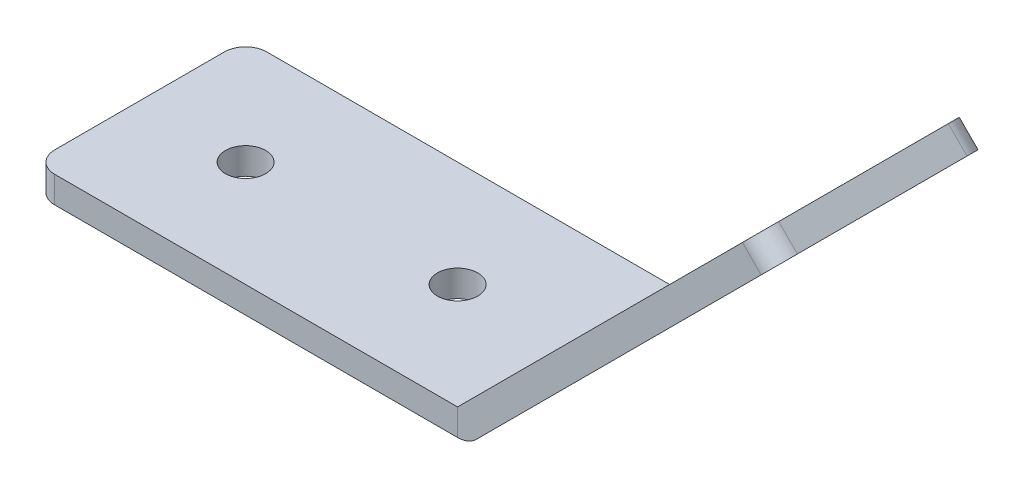
ISO-10303-21;
HEADER;
FILE_DESCRIPTION(('STEP AP214'),'2;1');
FILE_NAME('part.step','',(''),(''),'','','');
FILE_SCHEMA(('AUTOMOTIVE_DESIGN { 1 0 10303 214 1 1 1 1 }'));
ENDSEC;
DATA;
#1=APPLICATION_CONTEXT('core data for automotive mechanical design processes');
#2=APPLICATION_PROTOCOL_DEFINITION('international standard','automotive_design',2000,#1);
#3=PRODUCT_CONTEXT('',#1,'mechanical');
#4=PRODUCT('Part','Part','',(#3));
#5=PRODUCT_RELATED_PRODUCT_CATEGORY('part','',(#4));
#6=PRODUCT_DEFINITION_FORMATION('','',#4);
#7=PRODUCT_DEFINITION_CONTEXT('part definition',#1,'design');
#8=PRODUCT_DEFINITION('design','',#6,#7);
#9=PRODUCT_DEFINITION_SHAPE('','',#8);
#10=(LENGTH_UNIT() NAMED_UNIT(*) SI_UNIT(.MILLI.,.METRE.));
#11=(NAMED_UNIT(*) PLANE_ANGLE_UNIT() SI_UNIT($,.RADIAN.));
#12=(NAMED_UNIT(*) SI_UNIT($,.STERADIAN.) SOLID_ANGLE_UNIT());
#13=UNCERTAINTY_MEASURE_WITH_UNIT(LENGTH_MEASURE(1.E-05),#10,'distance_accuracy_value','');
#14=(GEOMETRIC_REPRESENTATION_CONTEXT(3) GLOBAL_UNCERTAINTY_ASSIGNED_CONTEXT((#13)) GLOBAL_UNIT_ASSIGNED_CONTEXT((#10,
#11,#12)) REPRESENTATION_CONTEXT('',''));
#15=CARTESIAN_POINT('',(0.,0.,0.));
#16=DIRECTION('',(0.,0.,1.));
#17=DIRECTION('',(1.,0.,0.));
#18=AXIS2_PLACEMENT_3D('',#15,#16,#17);
#19=CARTESIAN_POINT('',(50.8,3.175,-54.6365211463464));
#20=DIRECTION('',(-1.,0.,0.));
#21=DIRECTION('',(0.,0.,1.));
#22=AXIS2_PLACEMENT_3D('',#19,#20,#21);
#23=PLANE('',#22);
#24=DIRECTION('',(0.,1.,0.));
#25=VECTOR('',#24,1.);
#26=CARTESIAN_POINT('',(50.8,3.175,0.));
#27=LINE('',#26,#25);
#28=CARTESIAN_POINT('',(50.8,0.,0.));
#29=VERTEX_POINT('',#28);
#30=CARTESIAN_POINT('',(50.8,3.175,0.));
#31=VERTEX_POINT('',#30);
#32=EDGE_CURVE('E117',#29,#31,#27,.T.);
#33=ORIENTED_EDGE('',*,*,#32,.F.);
#34=DIRECTION('',(0.,0.,1.));
#35=VECTOR('',#34,1.);
#36=CARTESIAN_POINT('',(50.8,0.,-54.6365211463464));
#37=LINE('',#36,#35);
#38=CARTESIAN_POINT('',(50.8,0.,25.4));
#39=VERTEX_POINT('',#38);
#40=EDGE_CURVE('E112',#29,#39,#37,.T.);
#41=ORIENTED_EDGE('',*,*,#40,.T.);
#42=DIRECTION('',(0.,-1.,0.));
#43=VECTOR('',#42,1.);
#44=CARTESIAN_POINT('',(50.8,3.175,25.4));
#45=LINE('',#44,#43);
#46=CARTESIAN_POINT('',(50.8,3.175,25.4));
#47=VERTEX_POINT('',#46);
#48=EDGE_CURVE('E116',#47,#39,#45,.T.);
#49=ORIENTED_EDGE('',*,*,#48,.F.);
#50=DIRECTION('',(0.,0.,1.));
#51=VECTOR('',#50,1.);
#52=CARTESIAN_POINT('',(50.8,3.175,-54.6365211463464));
#53=LINE('',#52,#51);
#54=EDGE_CURVE('E152',#31,#47,#53,.T.);
#55=ORIENTED_EDGE('',*,*,#54,.F.);
#56=EDGE_LOOP('',(#33,#41,#49,#55));
#57=FACE_BOUND('',#56,.T.);
#58=ADVANCED_FACE('F49',(#57),#23,.T.);
#59=CARTESIAN_POINT('',(50.8,3.175,-54.6365211463464));
#60=DIRECTION('',(-0.707106781186549,0.707106781186547,0.));
#61=DIRECTION('',(-0.707106781186546,-0.707106781186549,0.));
#62=AXIS2_PLACEMENT_3D('',#59,#60,#61);
#63=PLANE('',#62);
#64=CARTESIAN_POINT('',(59.7802561210691,12.1552561210692,12.7));
#65=DIRECTION('',(-0.707106781186549,0.707106781186546,0.));
#66=DIRECTION('',(-0.707106781186546,-0.707106781186549,0.));
#67=AXIS2_PLACEMENT_3D('',#64,#65,#66);
#68=CIRCLE('',#67,2.413);
#69=CARTESIAN_POINT('',(58.074007458066,10.449007458066,12.7));
#70=VERTEX_POINT('',#69);
#71=EDGE_CURVE('E143',#70,#70,#68,.T.);
#72=ORIENTED_EDGE('',*,*,#71,.F.);
#73=EDGE_LOOP('',(#72));
#74=FACE_BOUND('',#73,.T.);
#75=CARTESIAN_POINT('',(77.7407683632074,30.1157683632075,12.7));
#76=DIRECTION('',(-0.707106781186549,0.707106781186546,0.));
#77=DIRECTION('',(-0.707106781186546,-0.707106781186549,0.));
#78=AXIS2_PLACEMENT_3D('',#75,#76,#77);
#79=CIRCLE('',#78,2.413);
#80=CARTESIAN_POINT('',(76.0345197002043,28.4095197002044,12.7));
#81=VERTEX_POINT('',#80);
#82=EDGE_CURVE('E209',#81,#81,#79,.T.);
#83=ORIENTED_EDGE('',*,*,#82,.F.);
#84=EDGE_LOOP('',(#83));
#85=FACE_BOUND('',#84,.T.);
#86=DIRECTION('',(-0.707106781186546,-0.707106781186549,0.));
#87=VECTOR('',#86,1.);
#88=CARTESIAN_POINT('',(50.8,3.175,25.4));
#89=LINE('',#88,#87);
#90=CARTESIAN_POINT('',(84.9249732600627,37.2999732600628,25.4));
#91=VERTEX_POINT('',#90);
#92=EDGE_CURVE('E122',#91,#47,#89,.T.);
#93=ORIENTED_EDGE('',*,*,#92,.F.);
#94=CARTESIAN_POINT('',(84.9249732600627,37.2999732600628,22.86));
#95=DIRECTION('',(-0.707106781186549,0.707106781186547,0.));
#96=DIRECTION('',(-0.707106781186546,-0.707106781186549,0.));
#97=AXIS2_PLACEMENT_3D('',#94,#95,#96);
#98=CIRCLE('',#97,2.54);
#99=CARTESIAN_POINT('',(86.7210244842766,39.0960244842767,22.86));
#100=VERTEX_POINT('',#99);
#101=EDGE_CURVE('E173',#91,#100,#98,.T.);
#102=ORIENTED_EDGE('',*,*,#101,.T.);
#103=DIRECTION('',(0.,0.,1.));
#104=VECTOR('',#103,1.);
#105=CARTESIAN_POINT('',(86.7210244842766,39.0960244842767,-54.6365211463464));
#106=LINE('',#105,#104);
#107=CARTESIAN_POINT('',(86.7210244842766,39.0960244842767,2.53999999999999));
#108=VERTEX_POINT('',#107);
#109=EDGE_CURVE('E156',#108,#100,#106,.T.);
#110=ORIENTED_EDGE('',*,*,#109,.F.);
#111=CARTESIAN_POINT('',(84.9249732600627,37.2999732600628,2.54));
#112=DIRECTION('',(-0.707106781186549,0.707106781186547,0.));
#113=DIRECTION('',(-0.707106781186546,-0.707106781186549,0.));
#114=AXIS2_PLACEMENT_3D('',#111,#112,#113);
#115=CIRCLE('',#114,2.54);
#116=CARTESIAN_POINT('',(84.9249732600627,37.2999732600628,0.));
#117=VERTEX_POINT('',#116);
#118=EDGE_CURVE('E170',#108,#117,#115,.T.);
#119=ORIENTED_EDGE('',*,*,#118,.T.);
#120=DIRECTION('',(0.707106781186546,0.707106781186549,0.));
#121=VECTOR('',#120,1.);
#122=CARTESIAN_POINT('',(50.8,3.175,0.));
#123=LINE('',#122,#121);
#124=EDGE_CURVE('E196',#31,#117,#123,.T.);
#125=ORIENTED_EDGE('',*,*,#124,.F.);
#126=ORIENTED_EDGE('',*,*,#54,.T.);
#127=EDGE_LOOP('',(#93,#102,#110,#119,#125,#126));
#128=FACE_BOUND('',#127,.T.);
#129=ADVANCED_FACE('F191',(#74,#85,#128),#63,.T.);
#130=CARTESIAN_POINT('',(88.9660885145438,36.8509604540094,-54.6365211463464));
#131=DIRECTION('',(0.707106781186545,0.70710678118655,0.));
#132=DIRECTION('',(-0.70710678118655,0.707106781186545,0.));
#133=AXIS2_PLACEMENT_3D('',#130,#131,#132);
#134=PLANE('',#133);
#135=ORIENTED_EDGE('',*,*,#109,.T.);
#136=DIRECTION('',(-0.70710678118655,0.707106781186545,0.));
#137=VECTOR('',#136,1.);
#138=CARTESIAN_POINT('',(88.9660885145438,36.8509604540094,22.86));
#139=LINE('',#138,#137);
#140=CARTESIAN_POINT('',(88.9660885145438,36.8509604540094,22.86));
#141=VERTEX_POINT('',#140);
#142=EDGE_CURVE('E72',#100,#141,#139,.F.);
#143=ORIENTED_EDGE('',*,*,#142,.T.);
#144=DIRECTION('',(0.,0.,1.));
#145=VECTOR('',#144,1.);
#146=CARTESIAN_POINT('',(88.9660885145438,36.8509604540094,-54.6365211463464));
#147=LINE('',#146,#145);
#148=CARTESIAN_POINT('',(88.9660885145438,36.8509604540094,2.53999999999999));
#149=VERTEX_POINT('',#148);
#150=EDGE_CURVE('E159',#149,#141,#147,.T.);
#151=ORIENTED_EDGE('',*,*,#150,.F.);
#152=DIRECTION('',(0.70710678118655,-0.707106781186545,0.));
#153=VECTOR('',#152,1.);
#154=CARTESIAN_POINT('',(86.7210244842766,39.0960244842767,2.54));
#155=LINE('',#154,#153);
#156=EDGE_CURVE('E176',#149,#108,#155,.F.);
#157=ORIENTED_EDGE('',*,*,#156,.T.);
#158=EDGE_LOOP('',(#135,#143,#151,#157));
#159=FACE_BOUND('',#158,.T.);
#160=ADVANCED_FACE('F193',(#159),#134,.T.);
#161=CARTESIAN_POINT('',(53.0450640302673,0.92993596973271,-54.6365211463464));
#162=DIRECTION('',(0.707106781186549,-0.707106781186546,0.));
#163=DIRECTION('',(0.707106781186546,0.707106781186549,0.));
#164=AXIS2_PLACEMENT_3D('',#161,#162,#163);
#165=PLANE('',#164);
#166=CARTESIAN_POINT('',(62.0253201513364,9.91019209080188,12.7));
#167=DIRECTION('',(0.707106781186549,-0.707106781186546,0.));
#168=DIRECTION('',(0.707106781186546,0.707106781186549,0.));
#169=AXIS2_PLACEMENT_3D('',#166,#167,#168);
#170=CIRCLE('',#169,2.413);
#171=CARTESIAN_POINT('',(63.7315688143396,11.616440753805,12.7));
#172=VERTEX_POINT('',#171);
#173=EDGE_CURVE('E139',#172,#172,#170,.F.);
#174=ORIENTED_EDGE('',*,*,#173,.T.);
#175=EDGE_LOOP('',(#174));
#176=FACE_BOUND('',#175,.T.);
#177=CARTESIAN_POINT('',(79.9858323934747,27.8707043329402,12.7));
#178=DIRECTION('',(0.707106781186549,-0.707106781186546,0.));
#179=DIRECTION('',(0.707106781186546,0.707106781186549,0.));
#180=AXIS2_PLACEMENT_3D('',#177,#178,#179);
#181=CIRCLE('',#180,2.413);
#182=CARTESIAN_POINT('',(81.6920810564778,29.5769529959434,12.7));
#183=VERTEX_POINT('',#182);
#184=EDGE_CURVE('E205',#183,#183,#181,.F.);
#185=ORIENTED_EDGE('',*,*,#184,.T.);
#186=EDGE_LOOP('',(#185));
#187=FACE_BOUND('',#186,.T.);
#188=ORIENTED_EDGE('',*,*,#150,.T.);
#189=CARTESIAN_POINT('',(87.17003729033,35.0549092297956,22.86));
#190=DIRECTION('',(0.707106781186549,-0.707106781186546,0.));
#191=DIRECTION('',(0.707106781186546,0.707106781186549,0.));
#192=AXIS2_PLACEMENT_3D('',#189,#190,#191);
#193=CIRCLE('',#192,2.54);
#194=CARTESIAN_POINT('',(87.17003729033,35.0549092297956,25.4));
#195=VERTEX_POINT('',#194);
#196=EDGE_CURVE('E58',#141,#195,#193,.T.);
#197=ORIENTED_EDGE('',*,*,#196,.T.);
#198=DIRECTION('',(0.707106781186546,0.707106781186549,0.));
#199=VECTOR('',#198,1.);
#200=CARTESIAN_POINT('',(53.0450640302673,0.92993596973271,25.4));
#201=LINE('',#200,#199);
#202=CARTESIAN_POINT('',(53.0450640302673,0.92993596973271,25.4));
#203=VERTEX_POINT('',#202);
#204=EDGE_CURVE('E132',#203,#195,#201,.T.);
#205=ORIENTED_EDGE('',*,*,#204,.F.);
#206=DIRECTION('',(0.,0.,1.));
#207=VECTOR('',#206,1.);
#208=CARTESIAN_POINT('',(53.0450640302673,0.92993596973271,-54.6365211463464));
#209=LINE('',#208,#207);
#210=CARTESIAN_POINT('',(53.0450640302673,0.92993596973271,0.));
#211=VERTEX_POINT('',#210);
#212=EDGE_CURVE('E121',#211,#203,#209,.T.);
#213=ORIENTED_EDGE('',*,*,#212,.F.);
#214=DIRECTION('',(-0.707106781186546,-0.707106781186549,0.));
#215=VECTOR('',#214,1.);
#216=CARTESIAN_POINT('',(53.0450640302673,0.92993596973271,0.));
#217=LINE('',#216,#215);
#218=CARTESIAN_POINT('',(87.17003729033,35.0549092297956,0.));
#219=VERTEX_POINT('',#218);
#220=EDGE_CURVE('E155',#219,#211,#217,.T.);
#221=ORIENTED_EDGE('',*,*,#220,.F.);
#222=CARTESIAN_POINT('',(87.17003729033,35.0549092297956,2.54));
#223=DIRECTION('',(0.707106781186549,-0.707106781186546,0.));
#224=DIRECTION('',(0.707106781186546,0.707106781186549,0.));
#225=AXIS2_PLACEMENT_3D('',#222,#223,#224);
#226=CIRCLE('',#225,2.54);
#227=EDGE_CURVE('E65',#219,#149,#226,.T.);
#228=ORIENTED_EDGE('',*,*,#227,.T.);
#229=EDGE_LOOP('',(#188,#197,#205,#213,#221,#228));
#230=FACE_BOUND('',#229,.T.);
#231=ADVANCED_FACE('F185',(#176,#187,#230),#165,.T.);
#232=CARTESIAN_POINT('',(50.8,3.175,-54.6365211463464));
#233=DIRECTION('',(0.,0.,1.));
#234=DIRECTION('',(1.,0.,0.));
#235=AXIS2_PLACEMENT_3D('',#232,#233,#234);
#236=CYLINDRICAL_SURFACE('',#235,3.17500000000001);
#237=CARTESIAN_POINT('',(50.8,3.175,0.));
#238=DIRECTION('',(0.,0.,1.));
#239=DIRECTION('',(1.,0.,0.));
#240=AXIS2_PLACEMENT_3D('',#237,#238,#239);
#241=CIRCLE('',#240,3.17500000000001);
#242=EDGE_CURVE('E164',#211,#29,#241,.F.);
#243=ORIENTED_EDGE('',*,*,#242,.F.);
#244=ORIENTED_EDGE('',*,*,#212,.T.);
#245=CARTESIAN_POINT('',(50.8,3.175,25.4));
#246=DIRECTION('',(0.,0.,1.));
#247=DIRECTION('',(1.,0.,0.));
#248=AXIS2_PLACEMENT_3D('',#245,#246,#247);
#249=CIRCLE('',#248,3.17500000000001);
#250=EDGE_CURVE('E125',#39,#203,#249,.T.);
#251=ORIENTED_EDGE('',*,*,#250,.F.);
#252=ORIENTED_EDGE('',*,*,#40,.F.);
#253=EDGE_LOOP('',(#243,#244,#251,#252));
#254=FACE_BOUND('',#253,.T.);
#255=ADVANCED_FACE('F126',(#254),#236,.T.);
#256=CARTESIAN_POINT('',(50.8,3.175,25.4));
#257=DIRECTION('',(0.,0.,1.));
#258=DIRECTION('',(1.,0.,0.));
#259=AXIS2_PLACEMENT_3D('',#256,#257,#258);
#260=PLANE('',#259);
#261=ORIENTED_EDGE('',*,*,#204,.T.);
#262=DIRECTION('',(-0.70710678118655,0.707106781186545,0.));
#263=VECTOR('',#262,1.);
#264=CARTESIAN_POINT('',(84.9249732600627,37.2999732600629,25.4));
#265=LINE('',#264,#263);
#266=EDGE_CURVE('E167',#195,#91,#265,.T.);
#267=ORIENTED_EDGE('',*,*,#266,.T.);
#268=ORIENTED_EDGE('',*,*,#92,.T.);
#269=ORIENTED_EDGE('',*,*,#48,.T.);
#270=ORIENTED_EDGE('',*,*,#250,.T.);
#271=EDGE_LOOP('',(#261,#267,#268,#269,#270));
#272=FACE_BOUND('',#271,.T.);
#273=ADVANCED_FACE('F134',(#272),#260,.T.);
#274=CARTESIAN_POINT('',(0.,3.175,0.));
#275=DIRECTION('',(0.,0.,1.));
#276=DIRECTION('',(1.,0.,0.));
#277=AXIS2_PLACEMENT_3D('',#274,#275,#276);
#278=PLANE('',#277);
#279=ORIENTED_EDGE('',*,*,#124,.T.);
#280=DIRECTION('',(0.70710678118655,-0.707106781186545,0.));
#281=VECTOR('',#280,1.);
#282=CARTESIAN_POINT('',(87.17003729033,35.0549092297956,0.));
#283=LINE('',#282,#281);
#284=EDGE_CURVE('E12',#117,#219,#283,.T.);
#285=ORIENTED_EDGE('',*,*,#284,.T.);
#286=ORIENTED_EDGE('',*,*,#220,.T.);
#287=ORIENTED_EDGE('',*,*,#242,.T.);
#288=ORIENTED_EDGE('',*,*,#32,.T.);
#289=EDGE_LOOP('',(#279,#285,#286,#287,#288));
#290=FACE_BOUND('',#289,.T.);
#291=ADVANCED_FACE('F198',(#290),#278,.F.);
#292=CARTESIAN_POINT('',(84.8118323934747,23.0447043329402,12.7));
#293=DIRECTION('',(-0.707106781186549,0.707106781186546,0.));
#294=DIRECTION('',(-0.707106781186546,-0.707106781186549,0.));
#295=AXIS2_PLACEMENT_3D('',#292,#293,#294);
#296=CYLINDRICAL_SURFACE('',#295,2.413);
#297=ORIENTED_EDGE('',*,*,#82,.T.);
#298=EDGE_LOOP('',(#297));
#299=FACE_BOUND('',#298,.T.);
#300=ORIENTED_EDGE('',*,*,#184,.F.);
#301=EDGE_LOOP('',(#300));
#302=FACE_BOUND('',#301,.T.);
#303=ADVANCED_FACE('F225',(#299,#302),#296,.F.);
#304=CARTESIAN_POINT('',(66.8513201513364,5.08419209080189,12.7));
#305=DIRECTION('',(-0.707106781186549,0.707106781186546,0.));
#306=DIRECTION('',(-0.707106781186546,-0.707106781186549,0.));
#307=AXIS2_PLACEMENT_3D('',#304,#305,#306);
#308=CYLINDRICAL_SURFACE('',#307,2.413);
#309=ORIENTED_EDGE('',*,*,#71,.T.);
#310=EDGE_LOOP('',(#309));
#311=FACE_BOUND('',#310,.T.);
#312=ORIENTED_EDGE('',*,*,#173,.F.);
#313=EDGE_LOOP('',(#312));
#314=FACE_BOUND('',#313,.T.);
#315=ADVANCED_FACE('F217',(#311,#314),#308,.F.);
#316=CARTESIAN_POINT('',(84.9249732600627,37.2999732600629,22.86));
#317=DIRECTION('',(-0.70710678118655,0.707106781186545,0.));
#318=DIRECTION('',(-0.707106781186545,-0.70710678118655,0.));
#319=AXIS2_PLACEMENT_3D('',#316,#317,#318);
#320=CYLINDRICAL_SURFACE('',#319,2.54);
#321=ORIENTED_EDGE('',*,*,#196,.F.);
#322=ORIENTED_EDGE('',*,*,#142,.F.);
#323=ORIENTED_EDGE('',*,*,#101,.F.);
#324=ORIENTED_EDGE('',*,*,#266,.F.);
#325=EDGE_LOOP('',(#321,#322,#323,#324));
#326=FACE_BOUND('',#325,.T.);
#327=ADVANCED_FACE('F188',(#326),#320,.T.);
#328=CARTESIAN_POINT('',(59.5249732600625,62.6999732600629,2.54));
#329=DIRECTION('',(-0.70710678118655,0.707106781186545,0.));
#330=DIRECTION('',(-0.707106781186545,-0.70710678118655,0.));
#331=AXIS2_PLACEMENT_3D('',#328,#329,#330);
#332=CYLINDRICAL_SURFACE('',#331,2.54);
#333=ORIENTED_EDGE('',*,*,#118,.F.);
#334=ORIENTED_EDGE('',*,*,#156,.F.);
#335=ORIENTED_EDGE('',*,*,#227,.F.);
#336=ORIENTED_EDGE('',*,*,#284,.F.);
#337=EDGE_LOOP('',(#333,#334,#335,#336));
#338=FACE_BOUND('',#337,.T.);
#339=ADVANCED_FACE('F51',(#338),#332,.T.);
#340=CLOSED_SHELL('',(#58,#129,#160,#231,#255,#273,#291,#303,#315,#327,#339));
#341=MANIFOLD_SOLID_BREP('B2',#340);
#342=CARTESIAN_POINT('',(0.,3.175,0.));
#343=DIRECTION('',(1.,0.,0.));
#344=DIRECTION('',(0.,0.,-1.));
#345=AXIS2_PLACEMENT_3D('',#342,#343,#344);
#346=PLANE('',#345);
#347=DIRECTION('',(0.,0.,1.));
#348=VECTOR('',#347,1.);
#349=CARTESIAN_POINT('',(0.,0.,0.));
#350=LINE('',#349,#348);
#351=CARTESIAN_POINT('',(0.,0.,2.54));
#352=VERTEX_POINT('',#351);
#353=CARTESIAN_POINT('',(0.,0.,22.86));
#354=VERTEX_POINT('',#353);
#355=EDGE_CURVE('E401',#352,#354,#350,.T.);
#356=ORIENTED_EDGE('',*,*,#355,.T.);
#357=DIRECTION('',(0.,-1.,0.));
#358=VECTOR('',#357,1.);
#359=CARTESIAN_POINT('',(0.,3.175,22.86));
#360=LINE('',#359,#358);
#361=CARTESIAN_POINT('',(0.,3.175,22.86));
#362=VERTEX_POINT('',#361);
#363=EDGE_CURVE('E339',#354,#362,#360,.F.);
#364=ORIENTED_EDGE('',*,*,#363,.T.);
#365=DIRECTION('',(0.,0.,1.));
#366=VECTOR('',#365,1.);
#367=CARTESIAN_POINT('',(0.,3.175,0.));
#368=LINE('',#367,#366);
#369=CARTESIAN_POINT('',(0.,3.175,2.54));
#370=VERTEX_POINT('',#369);
#371=EDGE_CURVE('E382',#370,#362,#368,.T.);
#372=ORIENTED_EDGE('',*,*,#371,.F.);
#373=DIRECTION('',(0.,-1.,0.));
#374=VECTOR('',#373,1.);
#375=CARTESIAN_POINT('',(0.,3.175,2.54));
#376=LINE('',#375,#374);
#377=EDGE_CURVE('E415',#370,#352,#376,.T.);
#378=ORIENTED_EDGE('',*,*,#377,.T.);
#379=EDGE_LOOP('',(#356,#364,#372,#378));
#380=FACE_BOUND('',#379,.T.);
#381=ADVANCED_FACE('F318',(#380),#346,.F.);
#382=CARTESIAN_POINT('',(0.,3.175,25.4));
#383=DIRECTION('',(0.,0.,-1.));
#384=DIRECTION('',(-1.,0.,0.));
#385=AXIS2_PLACEMENT_3D('',#382,#383,#384);
#386=PLANE('',#385);
#387=DIRECTION('',(1.,0.,0.));
#388=VECTOR('',#387,1.);
#389=CARTESIAN_POINT('',(0.,3.175,25.4));
#390=LINE('',#389,#388);
#391=CARTESIAN_POINT('',(2.54,3.175,25.4));
#392=VERTEX_POINT('',#391);
#393=CARTESIAN_POINT('',(50.8,3.175,25.4));
#394=VERTEX_POINT('',#393);
#395=EDGE_CURVE('E372',#392,#394,#390,.T.);
#396=ORIENTED_EDGE('',*,*,#395,.F.);
#397=DIRECTION('',(0.,-1.,0.));
#398=VECTOR('',#397,1.);
#399=CARTESIAN_POINT('',(2.54,3.175,25.4));
#400=LINE('',#399,#398);
#401=CARTESIAN_POINT('',(2.54,0.,25.4));
#402=VERTEX_POINT('',#401);
#403=EDGE_CURVE('E391',#392,#402,#400,.T.);
#404=ORIENTED_EDGE('',*,*,#403,.T.);
#405=DIRECTION('',(1.,0.,0.));
#406=VECTOR('',#405,1.);
#407=CARTESIAN_POINT('',(0.,0.,25.4));
#408=LINE('',#407,#406);
#409=CARTESIAN_POINT('',(50.8,0.,25.4));
#410=VERTEX_POINT('',#409);
#411=EDGE_CURVE('E388',#402,#410,#408,.T.);
#412=ORIENTED_EDGE('',*,*,#411,.T.);
#413=DIRECTION('',(0.,-1.,0.));
#414=VECTOR('',#413,1.);
#415=CARTESIAN_POINT('',(50.8,3.175,25.4));
#416=LINE('',#415,#414);
#417=EDGE_CURVE('E385',#394,#410,#416,.T.);
#418=ORIENTED_EDGE('',*,*,#417,.F.);
#419=EDGE_LOOP('',(#396,#404,#412,#418));
#420=FACE_BOUND('',#419,.T.);
#421=ADVANCED_FACE('F386',(#420),#386,.F.);
#422=CARTESIAN_POINT('',(50.8,3.175,0.));
#423=DIRECTION('',(-1.,0.,0.));
#424=DIRECTION('',(0.,0.,1.));
#425=AXIS2_PLACEMENT_3D('',#422,#423,#424);
#426=PLANE('',#425);
#427=DIRECTION('',(0.,0.,-1.));
#428=VECTOR('',#427,1.);
#429=CARTESIAN_POINT('',(50.8,0.,0.));
#430=LINE('',#429,#428);
#431=CARTESIAN_POINT('',(50.8,0.,0.));
#432=VERTEX_POINT('',#431);
#433=EDGE_CURVE('E405',#410,#432,#430,.T.);
#434=ORIENTED_EDGE('',*,*,#433,.T.);
#435=DIRECTION('',(0.,-1.,0.));
#436=VECTOR('',#435,1.);
#437=CARTESIAN_POINT('',(50.8,3.175,0.));
#438=LINE('',#437,#436);
#439=CARTESIAN_POINT('',(50.8,3.175,0.));
#440=VERTEX_POINT('',#439);
#441=EDGE_CURVE('E392',#440,#432,#438,.T.);
#442=ORIENTED_EDGE('',*,*,#441,.F.);
#443=DIRECTION('',(0.,0.,-1.));
#444=VECTOR('',#443,1.);
#445=CARTESIAN_POINT('',(50.8,3.175,0.));
#446=LINE('',#445,#444);
#447=EDGE_CURVE('E376',#394,#440,#446,.T.);
#448=ORIENTED_EDGE('',*,*,#447,.F.);
#449=ORIENTED_EDGE('',*,*,#417,.T.);
#450=EDGE_LOOP('',(#434,#442,#448,#449));
#451=FACE_BOUND('',#450,.T.);
#452=ADVANCED_FACE('F394',(#451),#426,.F.);
#453=CARTESIAN_POINT('',(0.,3.175,0.));
#454=DIRECTION('',(0.,0.,1.));
#455=DIRECTION('',(1.,0.,0.));
#456=AXIS2_PLACEMENT_3D('',#453,#454,#455);
#457=PLANE('',#456);
#458=DIRECTION('',(-1.,0.,0.));
#459=VECTOR('',#458,1.);
#460=CARTESIAN_POINT('',(0.,0.,0.));
#461=LINE('',#460,#459);
#462=CARTESIAN_POINT('',(2.54,0.,0.));
#463=VERTEX_POINT('',#462);
#464=EDGE_CURVE('E407',#432,#463,#461,.T.);
#465=ORIENTED_EDGE('',*,*,#464,.T.);
#466=DIRECTION('',(0.,-1.,0.));
#467=VECTOR('',#466,1.);
#468=CARTESIAN_POINT('',(2.54,3.175,0.));
#469=LINE('',#468,#467);
#470=CARTESIAN_POINT('',(2.54,3.175,0.));
#471=VERTEX_POINT('',#470);
#472=EDGE_CURVE('E47',#463,#471,#469,.F.);
#473=ORIENTED_EDGE('',*,*,#472,.T.);
#474=DIRECTION('',(-1.,0.,0.));
#475=VECTOR('',#474,1.);
#476=CARTESIAN_POINT('',(0.,3.175,0.));
#477=LINE('',#476,#475);
#478=EDGE_CURVE('E396',#440,#471,#477,.T.);
#479=ORIENTED_EDGE('',*,*,#478,.F.);
#480=ORIENTED_EDGE('',*,*,#441,.T.);
#481=EDGE_LOOP('',(#465,#473,#479,#480));
#482=FACE_BOUND('',#481,.T.);
#483=ADVANCED_FACE('F427',(#482),#457,.F.);
#484=CARTESIAN_POINT('',(0.,3.175,0.));
#485=DIRECTION('',(0.,1.,0.));
#486=DIRECTION('',(0.,0.,1.));
#487=AXIS2_PLACEMENT_3D('',#484,#485,#486);
#488=PLANE('',#487);
#489=CARTESIAN_POINT('',(38.1,3.175,12.7));
#490=DIRECTION('',(0.,1.,0.));
#491=DIRECTION('',(0.,0.,1.));
#492=AXIS2_PLACEMENT_3D('',#489,#490,#491);
#493=CIRCLE('',#492,2.41299999999999);
#494=CARTESIAN_POINT('',(38.1,3.175,15.113));
#495=VERTEX_POINT('',#494);
#496=EDGE_CURVE('E471',#495,#495,#493,.T.);
#497=ORIENTED_EDGE('',*,*,#496,.F.);
#498=EDGE_LOOP('',(#497));
#499=FACE_BOUND('',#498,.T.);
#500=CARTESIAN_POINT('',(12.7,3.175,12.7));
#501=DIRECTION('',(0.,1.,0.));
#502=DIRECTION('',(0.,0.,1.));
#503=AXIS2_PLACEMENT_3D('',#500,#501,#502);
#504=CIRCLE('',#503,2.413);
#505=CARTESIAN_POINT('',(12.7,3.175,15.113));
#506=VERTEX_POINT('',#505);
#507=EDGE_CURVE('E472',#506,#506,#504,.T.);
#508=ORIENTED_EDGE('',*,*,#507,.F.);
#509=EDGE_LOOP('',(#508));
#510=FACE_BOUND('',#509,.T.);
#511=ORIENTED_EDGE('',*,*,#371,.T.);
#512=CARTESIAN_POINT('',(2.54,3.175,22.86));
#513=DIRECTION('',(0.,1.,0.));
#514=DIRECTION('',(0.,0.,1.));
#515=AXIS2_PLACEMENT_3D('',#512,#513,#514);
#516=CIRCLE('',#515,2.54);
#517=EDGE_CURVE('E326',#362,#392,#516,.T.);
#518=ORIENTED_EDGE('',*,*,#517,.T.);
#519=ORIENTED_EDGE('',*,*,#395,.T.);
#520=ORIENTED_EDGE('',*,*,#447,.T.);
#521=ORIENTED_EDGE('',*,*,#478,.T.);
#522=CARTESIAN_POINT('',(2.54,3.175,2.54));
#523=DIRECTION('',(0.,1.,0.));
#524=DIRECTION('',(0.,0.,1.));
#525=AXIS2_PLACEMENT_3D('',#522,#523,#524);
#526=CIRCLE('',#525,2.54);
#527=EDGE_CURVE('E419',#471,#370,#526,.T.);
#528=ORIENTED_EDGE('',*,*,#527,.T.);
#529=EDGE_LOOP('',(#511,#518,#519,#520,#521,#528));
#530=FACE_BOUND('',#529,.T.);
#531=ADVANCED_FACE('F374',(#499,#510,#530),#488,.T.);
#532=CARTESIAN_POINT('',(0.,0.,0.));
#533=DIRECTION('',(0.,1.,0.));
#534=DIRECTION('',(0.,0.,1.));
#535=AXIS2_PLACEMENT_3D('',#532,#533,#534);
#536=PLANE('',#535);
#537=CARTESIAN_POINT('',(38.1,0.,12.7));
#538=DIRECTION('',(0.,1.,0.));
#539=DIRECTION('',(0.,0.,1.));
#540=AXIS2_PLACEMENT_3D('',#537,#538,#539);
#541=CIRCLE('',#540,2.41299999999999);
#542=CARTESIAN_POINT('',(38.1,0.,15.113));
#543=VERTEX_POINT('',#542);
#544=EDGE_CURVE('E403',#543,#543,#541,.F.);
#545=ORIENTED_EDGE('',*,*,#544,.F.);
#546=EDGE_LOOP('',(#545));
#547=FACE_BOUND('',#546,.T.);
#548=CARTESIAN_POINT('',(12.7,0.,12.7));
#549=DIRECTION('',(0.,1.,0.));
#550=DIRECTION('',(0.,0.,1.));
#551=AXIS2_PLACEMENT_3D('',#548,#549,#550);
#552=CIRCLE('',#551,2.413);
#553=CARTESIAN_POINT('',(12.7,0.,15.113));
#554=VERTEX_POINT('',#553);
#555=EDGE_CURVE('E470',#554,#554,#552,.F.);
#556=ORIENTED_EDGE('',*,*,#555,.F.);
#557=EDGE_LOOP('',(#556));
#558=FACE_BOUND('',#557,.T.);
#559=ORIENTED_EDGE('',*,*,#411,.F.);
#560=CARTESIAN_POINT('',(2.54,0.,22.86));
#561=DIRECTION('',(0.,1.,0.));
#562=DIRECTION('',(0.,0.,1.));
#563=AXIS2_PLACEMENT_3D('',#560,#561,#562);
#564=CIRCLE('',#563,2.54);
#565=EDGE_CURVE('E413',#402,#354,#564,.F.);
#566=ORIENTED_EDGE('',*,*,#565,.T.);
#567=ORIENTED_EDGE('',*,*,#355,.F.);
#568=CARTESIAN_POINT('',(2.54,0.,2.54));
#569=DIRECTION('',(0.,1.,0.));
#570=DIRECTION('',(0.,0.,1.));
#571=AXIS2_PLACEMENT_3D('',#568,#569,#570);
#572=CIRCLE('',#571,2.54);
#573=EDGE_CURVE('E411',#352,#463,#572,.F.);
#574=ORIENTED_EDGE('',*,*,#573,.T.);
#575=ORIENTED_EDGE('',*,*,#464,.F.);
#576=ORIENTED_EDGE('',*,*,#433,.F.);
#577=EDGE_LOOP('',(#559,#566,#567,#574,#575,#576));
#578=FACE_BOUND('',#577,.T.);
#579=ADVANCED_FACE('F426',(#547,#558,#578),#536,.F.);
#580=CARTESIAN_POINT('',(12.7,-6.82499465201255,12.7));
#581=DIRECTION('',(0.,1.,0.));
#582=DIRECTION('',(0.,0.,1.));
#583=AXIS2_PLACEMENT_3D('',#580,#581,#582);
#584=CYLINDRICAL_SURFACE('',#583,2.413);
#585=ORIENTED_EDGE('',*,*,#555,.T.);
#586=EDGE_LOOP('',(#585));
#587=FACE_BOUND('',#586,.T.);
#588=ORIENTED_EDGE('',*,*,#507,.T.);
#589=EDGE_LOOP('',(#588));
#590=FACE_BOUND('',#589,.T.);
#591=ADVANCED_FACE('F452',(#587,#590),#584,.F.);
#592=CARTESIAN_POINT('',(38.1,-6.82499465201255,12.7));
#593=DIRECTION('',(0.,1.,0.));
#594=DIRECTION('',(0.,0.,1.));
#595=AXIS2_PLACEMENT_3D('',#592,#593,#594);
#596=CYLINDRICAL_SURFACE('',#595,2.41299999999999);
#597=ORIENTED_EDGE('',*,*,#544,.T.);
#598=EDGE_LOOP('',(#597));
#599=FACE_BOUND('',#598,.T.);
#600=ORIENTED_EDGE('',*,*,#496,.T.);
#601=EDGE_LOOP('',(#600));
#602=FACE_BOUND('',#601,.T.);
#603=ADVANCED_FACE('F446',(#599,#602),#596,.F.);
#604=CARTESIAN_POINT('',(2.54,3.175,22.86));
#605=DIRECTION('',(0.,-1.,0.));
#606=DIRECTION('',(0.,0.,-1.));
#607=AXIS2_PLACEMENT_3D('',#604,#605,#606);
#608=CYLINDRICAL_SURFACE('',#607,2.54);
#609=ORIENTED_EDGE('',*,*,#517,.F.);
#610=ORIENTED_EDGE('',*,*,#363,.F.);
#611=ORIENTED_EDGE('',*,*,#565,.F.);
#612=ORIENTED_EDGE('',*,*,#403,.F.);
#613=EDGE_LOOP('',(#609,#610,#611,#612));
#614=FACE_BOUND('',#613,.T.);
#615=ADVANCED_FACE('F444',(#614),#608,.T.);
#616=CARTESIAN_POINT('',(2.54,3.175,2.54));
#617=DIRECTION('',(0.,-1.,0.));
#618=DIRECTION('',(0.,0.,-1.));
#619=AXIS2_PLACEMENT_3D('',#616,#617,#618);
#620=CYLINDRICAL_SURFACE('',#619,2.54);
#621=ORIENTED_EDGE('',*,*,#527,.F.);
#622=ORIENTED_EDGE('',*,*,#472,.F.);
#623=ORIENTED_EDGE('',*,*,#573,.F.);
#624=ORIENTED_EDGE('',*,*,#377,.F.);
#625=EDGE_LOOP('',(#621,#622,#623,#624));
#626=FACE_BOUND('',#625,.T.);
#627=ADVANCED_FACE('F320',(#626),#620,.T.);
#628=CLOSED_SHELL('',(#381,#421,#452,#483,#531,#579,#591,#603,#615,#627));
#629=MANIFOLD_SOLID_BREP('B6',#628);
#630=ADVANCED_BREP_SHAPE_REPRESENTATION('',(#18,#341,#629),#14);
#631=SHAPE_DEFINITION_REPRESENTATION(#9,#630);
ENDSEC;
END-ISO-10303-21;
